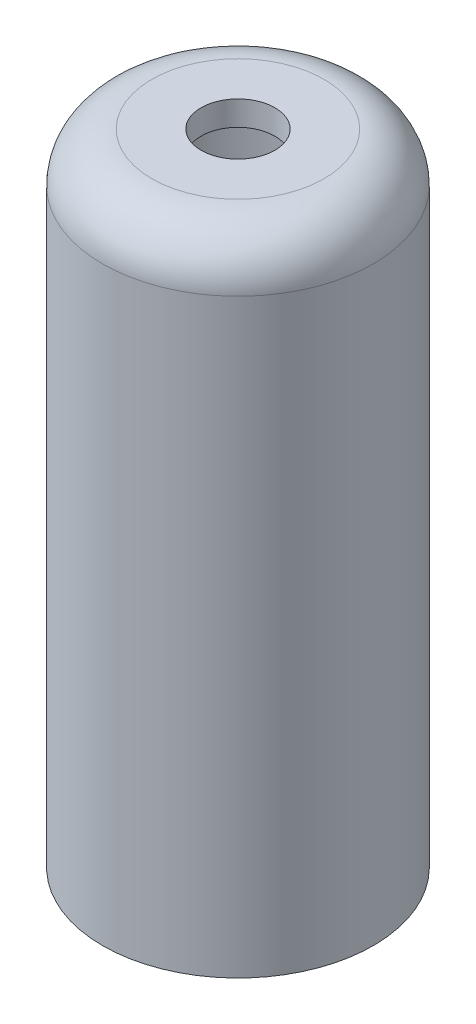
ISO-10303-21;
HEADER;
FILE_DESCRIPTION(('STEP AP214'),'2;1');
FILE_NAME('part.step','',(''),(''),'','','');
FILE_SCHEMA(('AUTOMOTIVE_DESIGN { 1 0 10303 214 1 1 1 1 }'));
ENDSEC;
DATA;
#1=APPLICATION_CONTEXT('core data for automotive mechanical design processes');
#2=APPLICATION_PROTOCOL_DEFINITION('international standard','automotive_design',2000,#1);
#3=PRODUCT_CONTEXT('',#1,'mechanical');
#4=PRODUCT('Part','Part','',(#3));
#5=PRODUCT_RELATED_PRODUCT_CATEGORY('part','',(#4));
#6=PRODUCT_DEFINITION_FORMATION('','',#4);
#7=PRODUCT_DEFINITION_CONTEXT('part definition',#1,'design');
#8=PRODUCT_DEFINITION('design','',#6,#7);
#9=PRODUCT_DEFINITION_SHAPE('','',#8);
#10=(LENGTH_UNIT() NAMED_UNIT(*) SI_UNIT(.MILLI.,.METRE.));
#11=(NAMED_UNIT(*) PLANE_ANGLE_UNIT() SI_UNIT($,.RADIAN.));
#12=(NAMED_UNIT(*) SI_UNIT($,.STERADIAN.) SOLID_ANGLE_UNIT());
#13=UNCERTAINTY_MEASURE_WITH_UNIT(LENGTH_MEASURE(1.E-05),#10,'distance_accuracy_value','');
#14=(GEOMETRIC_REPRESENTATION_CONTEXT(3) GLOBAL_UNCERTAINTY_ASSIGNED_CONTEXT((#13)) GLOBAL_UNIT_ASSIGNED_CONTEXT((#10,
#11,#12)) REPRESENTATION_CONTEXT('',''));
#15=CARTESIAN_POINT('',(0.,0.,0.));
#16=DIRECTION('',(0.,0.,1.));
#17=DIRECTION('',(1.,0.,0.));
#18=AXIS2_PLACEMENT_3D('',#15,#16,#17);
#19=CARTESIAN_POINT('',(0.,-82.55,0.));
#20=DIRECTION('',(0.,1.,0.));
#21=DIRECTION('',(0.,0.,1.));
#22=AXIS2_PLACEMENT_3D('',#19,#20,#21);
#23=CYLINDRICAL_SURFACE('',#22,17.4625);
#24=CARTESIAN_POINT('',(0.,-6.34999999999999,0.));
#25=DIRECTION('',(0.,1.,0.));
#26=DIRECTION('',(0.,0.,1.));
#27=AXIS2_PLACEMENT_3D('',#24,#25,#26);
#28=CIRCLE('',#27,17.4625);
#29=CARTESIAN_POINT('',(0.,-6.34999999999999,17.4625));
#30=VERTEX_POINT('',#29);
#31=EDGE_CURVE('E10',#30,#30,#28,.F.);
#32=ORIENTED_EDGE('',*,*,#31,.T.);
#33=EDGE_LOOP('',(#32));
#34=FACE_BOUND('',#33,.T.);
#35=CARTESIAN_POINT('',(0.,-82.55,0.));
#36=DIRECTION('',(0.,1.,0.));
#37=DIRECTION('',(0.,0.,1.));
#38=AXIS2_PLACEMENT_3D('',#35,#36,#37);
#39=CIRCLE('',#38,17.4625);
#40=CARTESIAN_POINT('',(0.,-82.55,17.4625));
#41=VERTEX_POINT('',#40);
#42=EDGE_CURVE('E44',#41,#41,#39,.T.);
#43=ORIENTED_EDGE('',*,*,#42,.T.);
#44=EDGE_LOOP('',(#43));
#45=FACE_BOUND('',#44,.T.);
#46=ADVANCED_FACE('F33',(#34,#45),#23,.T.);
#47=CARTESIAN_POINT('',(0.,-82.55,0.));
#48=DIRECTION('',(0.,1.,0.));
#49=DIRECTION('',(0.,0.,1.));
#50=AXIS2_PLACEMENT_3D('',#47,#48,#49);
#51=PLANE('',#50);
#52=CARTESIAN_POINT('',(0.,-82.55,0.));
#53=DIRECTION('',(0.,-1.,0.));
#54=DIRECTION('',(0.,0.,-1.));
#55=AXIS2_PLACEMENT_3D('',#52,#53,#54);
#56=CIRCLE('',#55,14.2875);
#57=CARTESIAN_POINT('',(0.,-82.55,-14.2875));
#58=VERTEX_POINT('',#57);
#59=EDGE_CURVE('E53',#58,#58,#56,.T.);
#60=ORIENTED_EDGE('',*,*,#59,.F.);
#61=EDGE_LOOP('',(#60));
#62=FACE_BOUND('',#61,.T.);
#63=ORIENTED_EDGE('',*,*,#42,.F.);
#64=EDGE_LOOP('',(#63));
#65=FACE_BOUND('',#64,.T.);
#66=ADVANCED_FACE('F68',(#62,#65),#51,.F.);
#67=CARTESIAN_POINT('',(0.,0.,0.));
#68=DIRECTION('',(0.,1.,0.));
#69=DIRECTION('',(0.,0.,1.));
#70=AXIS2_PLACEMENT_3D('',#67,#68,#69);
#71=PLANE('',#70);
#72=CARTESIAN_POINT('',(0.,0.,0.));
#73=DIRECTION('',(0.,1.,0.));
#74=DIRECTION('',(0.,0.,1.));
#75=AXIS2_PLACEMENT_3D('',#72,#73,#74);
#76=CIRCLE('',#75,11.1125);
#77=CARTESIAN_POINT('',(0.,0.,11.1125));
#78=VERTEX_POINT('',#77);
#79=EDGE_CURVE('E40',#78,#78,#76,.T.);
#80=ORIENTED_EDGE('',*,*,#79,.T.);
#81=EDGE_LOOP('',(#80));
#82=FACE_BOUND('',#81,.T.);
#83=CARTESIAN_POINT('',(0.,0.,0.));
#84=DIRECTION('',(0.,1.,0.));
#85=DIRECTION('',(0.,0.,1.));
#86=AXIS2_PLACEMENT_3D('',#83,#84,#85);
#87=CIRCLE('',#86,4.7625);
#88=CARTESIAN_POINT('',(0.,0.,4.7625));
#89=VERTEX_POINT('',#88);
#90=EDGE_CURVE('E54',#89,#89,#87,.T.);
#91=ORIENTED_EDGE('',*,*,#90,.F.);
#92=EDGE_LOOP('',(#91));
#93=FACE_BOUND('',#92,.T.);
#94=ADVANCED_FACE('F65',(#82,#93),#71,.T.);
#95=CARTESIAN_POINT('',(0.,-3.175,0.));
#96=DIRECTION('',(0.,-1.,0.));
#97=DIRECTION('',(0.,0.,-1.));
#98=AXIS2_PLACEMENT_3D('',#95,#96,#97);
#99=CYLINDRICAL_SURFACE('',#98,14.2875);
#100=CARTESIAN_POINT('',(0.,-3.175,0.));
#101=DIRECTION('',(0.,-1.,0.));
#102=DIRECTION('',(0.,0.,-1.));
#103=AXIS2_PLACEMENT_3D('',#100,#101,#102);
#104=CIRCLE('',#103,14.2875);
#105=CARTESIAN_POINT('',(0.,-3.175,-14.2875));
#106=VERTEX_POINT('',#105);
#107=EDGE_CURVE('E48',#106,#106,#104,.T.);
#108=ORIENTED_EDGE('',*,*,#107,.F.);
#109=EDGE_LOOP('',(#108));
#110=FACE_BOUND('',#109,.T.);
#111=ORIENTED_EDGE('',*,*,#59,.T.);
#112=EDGE_LOOP('',(#111));
#113=FACE_BOUND('',#112,.T.);
#114=ADVANCED_FACE('F67',(#110,#113),#99,.F.);
#115=CARTESIAN_POINT('',(0.,-3.175,0.));
#116=DIRECTION('',(0.,-1.,0.));
#117=DIRECTION('',(0.,0.,-1.));
#118=AXIS2_PLACEMENT_3D('',#115,#116,#117);
#119=PLANE('',#118);
#120=CARTESIAN_POINT('',(0.,-3.175,0.));
#121=DIRECTION('',(0.,-1.,0.));
#122=DIRECTION('',(0.,0.,-1.));
#123=AXIS2_PLACEMENT_3D('',#120,#121,#122);
#124=CIRCLE('',#123,4.7625);
#125=CARTESIAN_POINT('',(0.,-3.175,-4.7625));
#126=VERTEX_POINT('',#125);
#127=EDGE_CURVE('E51',#126,#126,#124,.T.);
#128=ORIENTED_EDGE('',*,*,#127,.F.);
#129=EDGE_LOOP('',(#128));
#130=FACE_BOUND('',#129,.T.);
#131=ORIENTED_EDGE('',*,*,#107,.T.);
#132=EDGE_LOOP('',(#131));
#133=FACE_BOUND('',#132,.T.);
#134=ADVANCED_FACE('F74',(#130,#133),#119,.T.);
#135=CARTESIAN_POINT('',(0.,-82.55,0.));
#136=DIRECTION('',(0.,1.,0.));
#137=DIRECTION('',(0.,0.,1.));
#138=AXIS2_PLACEMENT_3D('',#135,#136,#137);
#139=CYLINDRICAL_SURFACE('',#138,4.7625);
#140=ORIENTED_EDGE('',*,*,#127,.T.);
#141=EDGE_LOOP('',(#140));
#142=FACE_BOUND('',#141,.T.);
#143=ORIENTED_EDGE('',*,*,#90,.T.);
#144=EDGE_LOOP('',(#143));
#145=FACE_BOUND('',#144,.T.);
#146=ADVANCED_FACE('F63',(#142,#145),#139,.F.);
#147=CARTESIAN_POINT('',(0.,-6.34999999999999,0.));
#148=DIRECTION('',(0.,1.,0.));
#149=DIRECTION('',(0.,0.,1.));
#150=AXIS2_PLACEMENT_3D('',#147,#148,#149);
#151=TOROIDAL_SURFACE('',#150,11.1125,6.35);
#152=ORIENTED_EDGE('',*,*,#31,.F.);
#153=EDGE_LOOP('',(#152));
#154=FACE_BOUND('',#153,.T.);
#155=ORIENTED_EDGE('',*,*,#79,.F.);
#156=EDGE_LOOP('',(#155));
#157=FACE_BOUND('',#156,.T.);
#158=ADVANCED_FACE('F35',(#154,#157),#151,.T.);
#159=CLOSED_SHELL('',(#46,#66,#94,#114,#134,#146,#158));
#160=MANIFOLD_SOLID_BREP('B2',#159);
#161=ADVANCED_BREP_SHAPE_REPRESENTATION('',(#18,#160),#14);
#162=SHAPE_DEFINITION_REPRESENTATION(#9,#161);
ENDSEC;
END-ISO-10303-21;
